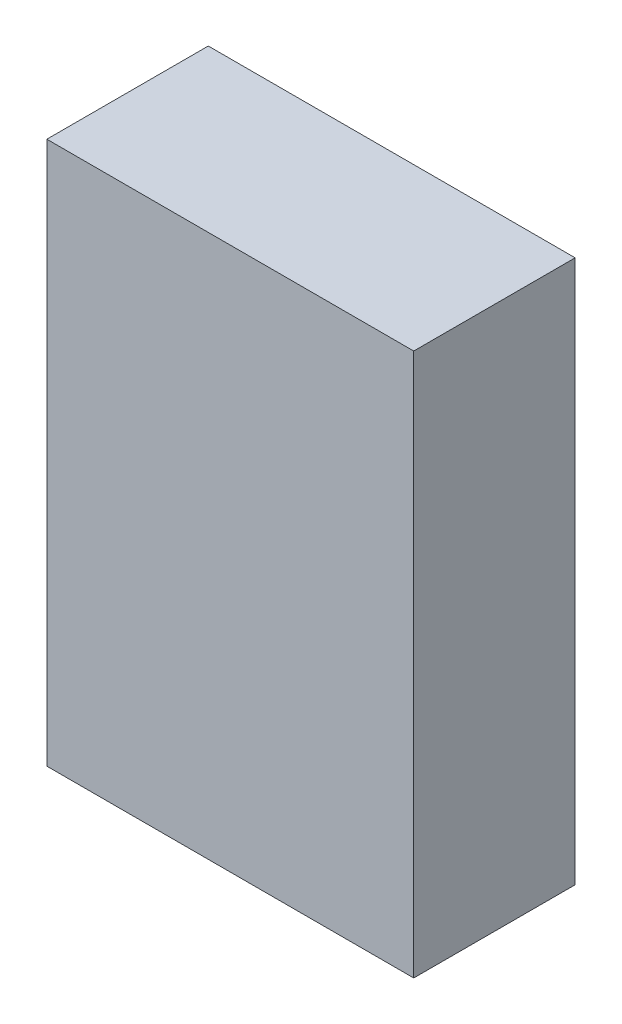
ISO-10303-21;
HEADER;
FILE_DESCRIPTION(('STEP AP214'),'2;1');
FILE_NAME('part.step','',(''),(''),'','','');
FILE_SCHEMA(('AUTOMOTIVE_DESIGN { 1 0 10303 214 1 1 1 1 }'));
ENDSEC;
DATA;
#1=APPLICATION_CONTEXT('core data for automotive mechanical design processes');
#2=APPLICATION_PROTOCOL_DEFINITION('international standard','automotive_design',2000,#1);
#3=PRODUCT_CONTEXT('',#1,'mechanical');
#4=PRODUCT('Part','Part','',(#3));
#5=PRODUCT_RELATED_PRODUCT_CATEGORY('part','',(#4));
#6=PRODUCT_DEFINITION_FORMATION('','',#4);
#7=PRODUCT_DEFINITION_CONTEXT('part definition',#1,'design');
#8=PRODUCT_DEFINITION('design','',#6,#7);
#9=PRODUCT_DEFINITION_SHAPE('','',#8);
#10=(LENGTH_UNIT() NAMED_UNIT(*) SI_UNIT(.MILLI.,.METRE.));
#11=(NAMED_UNIT(*) PLANE_ANGLE_UNIT() SI_UNIT($,.RADIAN.));
#12=(NAMED_UNIT(*) SI_UNIT($,.STERADIAN.) SOLID_ANGLE_UNIT());
#13=UNCERTAINTY_MEASURE_WITH_UNIT(LENGTH_MEASURE(1.E-05),#10,'distance_accuracy_value','');
#14=(GEOMETRIC_REPRESENTATION_CONTEXT(3) GLOBAL_UNCERTAINTY_ASSIGNED_CONTEXT((#13)) GLOBAL_UNIT_ASSIGNED_CONTEXT((#10,
#11,#12)) REPRESENTATION_CONTEXT('',''));
#15=CARTESIAN_POINT('',(0.,0.,0.));
#16=DIRECTION('',(0.,0.,1.));
#17=DIRECTION('',(1.,0.,0.));
#18=AXIS2_PLACEMENT_3D('',#15,#16,#17);
#19=CARTESIAN_POINT('',(-3.75000012,5.5500016,3.3));
#20=DIRECTION('',(0.,0.,-1.));
#21=DIRECTION('',(-1.,0.,0.));
#22=AXIS2_PLACEMENT_3D('',#19,#20,#21);
#23=PLANE('',#22);
#24=DIRECTION('',(1.,0.,0.));
#25=VECTOR('',#24,1.);
#26=CARTESIAN_POINT('',(-3.75000012,-5.54999906,3.3));
#27=LINE('',#26,#25);
#28=CARTESIAN_POINT('',(-3.75000012,-5.54999906,3.3));
#29=VERTEX_POINT('',#28);
#30=CARTESIAN_POINT('',(3.75000012,-5.54999906,3.3));
#31=VERTEX_POINT('',#30);
#32=EDGE_CURVE('E55',#29,#31,#27,.T.);
#33=ORIENTED_EDGE('',*,*,#32,.T.);
#34=DIRECTION('',(0.,1.,0.));
#35=VECTOR('',#34,1.);
#36=CARTESIAN_POINT('',(3.75000012,-5.54999906,3.3));
#37=LINE('',#36,#35);
#38=CARTESIAN_POINT('',(3.75000012,5.5500016,3.3));
#39=VERTEX_POINT('',#38);
#40=EDGE_CURVE('E57',#31,#39,#37,.T.);
#41=ORIENTED_EDGE('',*,*,#40,.T.);
#42=DIRECTION('',(1.,0.,0.));
#43=VECTOR('',#42,1.);
#44=CARTESIAN_POINT('',(3.75000012,5.5500016,3.3));
#45=LINE('',#44,#43);
#46=CARTESIAN_POINT('',(-3.75000012,5.5500016,3.3));
#47=VERTEX_POINT('',#46);
#48=EDGE_CURVE('E20',#39,#47,#45,.F.);
#49=ORIENTED_EDGE('',*,*,#48,.T.);
#50=DIRECTION('',(0.,1.,0.));
#51=VECTOR('',#50,1.);
#52=CARTESIAN_POINT('',(-3.75000012,5.5500016,3.3));
#53=LINE('',#52,#51);
#54=EDGE_CURVE('E80',#47,#29,#53,.F.);
#55=ORIENTED_EDGE('',*,*,#54,.T.);
#56=EDGE_LOOP('',(#33,#41,#49,#55));
#57=FACE_BOUND('',#56,.T.);
#58=ADVANCED_FACE('F17',(#57),#23,.F.);
#59=CARTESIAN_POINT('',(3.75000012,5.5500016,0.));
#60=DIRECTION('',(0.,-1.,0.));
#61=DIRECTION('',(0.,0.,-1.));
#62=AXIS2_PLACEMENT_3D('',#59,#60,#61);
#63=PLANE('',#62);
#64=DIRECTION('',(0.,0.,-1.));
#65=VECTOR('',#64,1.);
#66=CARTESIAN_POINT('',(-3.75000012,5.5500016,0.));
#67=LINE('',#66,#65);
#68=CARTESIAN_POINT('',(-3.75000012,5.5500016,0.));
#69=VERTEX_POINT('',#68);
#70=EDGE_CURVE('E68',#69,#47,#67,.F.);
#71=ORIENTED_EDGE('',*,*,#70,.T.);
#72=ORIENTED_EDGE('',*,*,#48,.F.);
#73=DIRECTION('',(0.,0.,1.));
#74=VECTOR('',#73,1.);
#75=CARTESIAN_POINT('',(3.75000012,5.5500016,0.));
#76=LINE('',#75,#74);
#77=CARTESIAN_POINT('',(3.75000012,5.5500016,0.));
#78=VERTEX_POINT('',#77);
#79=EDGE_CURVE('E63',#39,#78,#76,.F.);
#80=ORIENTED_EDGE('',*,*,#79,.T.);
#81=DIRECTION('',(-1.,0.,0.));
#82=VECTOR('',#81,1.);
#83=CARTESIAN_POINT('',(-3.75000012,5.5500016,0.));
#84=LINE('',#83,#82);
#85=EDGE_CURVE('E83',#69,#78,#84,.F.);
#86=ORIENTED_EDGE('',*,*,#85,.F.);
#87=EDGE_LOOP('',(#71,#72,#80,#86));
#88=FACE_BOUND('',#87,.T.);
#89=ADVANCED_FACE('F65',(#88),#63,.F.);
#90=CARTESIAN_POINT('',(3.75000012,-5.54999906,0.));
#91=DIRECTION('',(-1.,0.,0.));
#92=DIRECTION('',(0.,0.,1.));
#93=AXIS2_PLACEMENT_3D('',#90,#91,#92);
#94=PLANE('',#93);
#95=ORIENTED_EDGE('',*,*,#79,.F.);
#96=ORIENTED_EDGE('',*,*,#40,.F.);
#97=DIRECTION('',(0.,0.,1.));
#98=VECTOR('',#97,1.);
#99=CARTESIAN_POINT('',(3.75000012,-5.54999906,0.));
#100=LINE('',#99,#98);
#101=CARTESIAN_POINT('',(3.75000012,-5.54999906,0.));
#102=VERTEX_POINT('',#101);
#103=EDGE_CURVE('E75',#31,#102,#100,.F.);
#104=ORIENTED_EDGE('',*,*,#103,.T.);
#105=DIRECTION('',(0.,1.,0.));
#106=VECTOR('',#105,1.);
#107=CARTESIAN_POINT('',(3.75000012,5.5500016,0.));
#108=LINE('',#107,#106);
#109=EDGE_CURVE('E72',#78,#102,#108,.F.);
#110=ORIENTED_EDGE('',*,*,#109,.F.);
#111=EDGE_LOOP('',(#95,#96,#104,#110));
#112=FACE_BOUND('',#111,.T.);
#113=ADVANCED_FACE('F70',(#112),#94,.F.);
#114=CARTESIAN_POINT('',(-3.75000012,-5.54999906,0.));
#115=DIRECTION('',(0.,1.,0.));
#116=DIRECTION('',(0.,0.,1.));
#117=AXIS2_PLACEMENT_3D('',#114,#115,#116);
#118=PLANE('',#117);
#119=ORIENTED_EDGE('',*,*,#103,.F.);
#120=ORIENTED_EDGE('',*,*,#32,.F.);
#121=DIRECTION('',(0.,0.,-1.));
#122=VECTOR('',#121,1.);
#123=CARTESIAN_POINT('',(-3.75000012,-5.54999906,0.));
#124=LINE('',#123,#122);
#125=CARTESIAN_POINT('',(-3.75000012,-5.54999906,0.));
#126=VERTEX_POINT('',#125);
#127=EDGE_CURVE('E35',#29,#126,#124,.T.);
#128=ORIENTED_EDGE('',*,*,#127,.T.);
#129=DIRECTION('',(-1.,0.,0.));
#130=VECTOR('',#129,1.);
#131=CARTESIAN_POINT('',(-3.75000012,-5.54999906,0.));
#132=LINE('',#131,#130);
#133=EDGE_CURVE('E26',#102,#126,#132,.T.);
#134=ORIENTED_EDGE('',*,*,#133,.F.);
#135=EDGE_LOOP('',(#119,#120,#128,#134));
#136=FACE_BOUND('',#135,.T.);
#137=ADVANCED_FACE('F89',(#136),#118,.F.);
#138=CARTESIAN_POINT('',(-3.75000012,5.5500016,0.));
#139=DIRECTION('',(1.,0.,0.));
#140=DIRECTION('',(0.,0.,-1.));
#141=AXIS2_PLACEMENT_3D('',#138,#139,#140);
#142=PLANE('',#141);
#143=ORIENTED_EDGE('',*,*,#127,.F.);
#144=ORIENTED_EDGE('',*,*,#54,.F.);
#145=ORIENTED_EDGE('',*,*,#70,.F.);
#146=DIRECTION('',(0.,1.,0.));
#147=VECTOR('',#146,1.);
#148=CARTESIAN_POINT('',(-3.75000012,5.5500016,0.));
#149=LINE('',#148,#147);
#150=EDGE_CURVE('E11',#126,#69,#149,.T.);
#151=ORIENTED_EDGE('',*,*,#150,.F.);
#152=EDGE_LOOP('',(#143,#144,#145,#151));
#153=FACE_BOUND('',#152,.T.);
#154=ADVANCED_FACE('F91',(#153),#142,.F.);
#155=CARTESIAN_POINT('',(-3.75000012,5.5500016,0.));
#156=DIRECTION('',(0.,0.,-1.));
#157=DIRECTION('',(-1.,0.,0.));
#158=AXIS2_PLACEMENT_3D('',#155,#156,#157);
#159=PLANE('',#158);
#160=ORIENTED_EDGE('',*,*,#133,.T.);
#161=ORIENTED_EDGE('',*,*,#150,.T.);
#162=ORIENTED_EDGE('',*,*,#85,.T.);
#163=ORIENTED_EDGE('',*,*,#109,.T.);
#164=EDGE_LOOP('',(#160,#161,#162,#163));
#165=FACE_BOUND('',#164,.T.);
#166=ADVANCED_FACE('F88',(#165),#159,.T.);
#167=CLOSED_SHELL('',(#58,#89,#113,#137,#154,#166));
#168=MANIFOLD_SOLID_BREP('B1',#167);
#169=ADVANCED_BREP_SHAPE_REPRESENTATION('',(#18,#168),#14);
#170=SHAPE_DEFINITION_REPRESENTATION(#9,#169);
ENDSEC;
END-ISO-10303-21;
